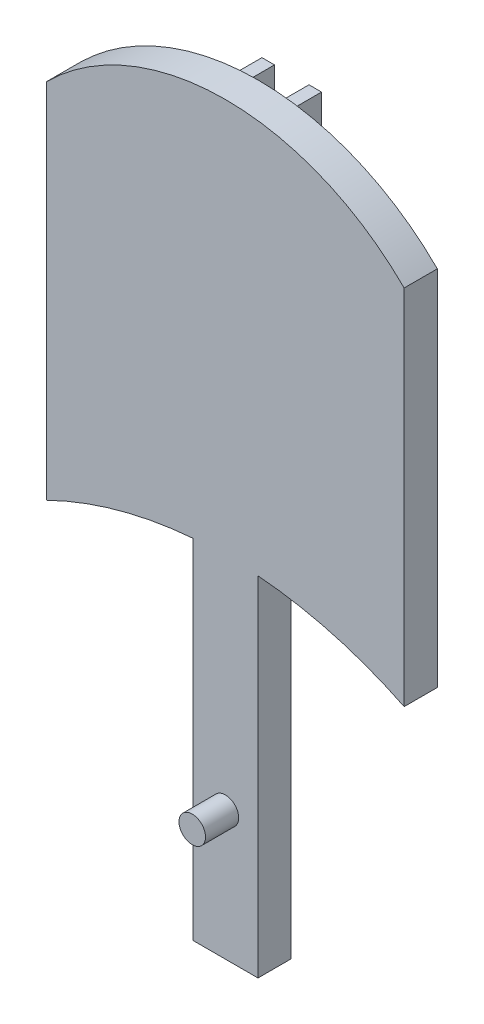
ISO-10303-21;
HEADER;
FILE_DESCRIPTION(('STEP AP214'),'2;1');
FILE_NAME('part.step','',(''),(''),'','','');
FILE_SCHEMA(('AUTOMOTIVE_DESIGN { 1 0 10303 214 1 1 1 1 }'));
ENDSEC;
DATA;
#1=APPLICATION_CONTEXT('core data for automotive mechanical design processes');
#2=APPLICATION_PROTOCOL_DEFINITION('international standard','automotive_design',2000,#1);
#3=PRODUCT_CONTEXT('',#1,'mechanical');
#4=PRODUCT('Part','Part','',(#3));
#5=PRODUCT_RELATED_PRODUCT_CATEGORY('part','',(#4));
#6=PRODUCT_DEFINITION_FORMATION('','',#4);
#7=PRODUCT_DEFINITION_CONTEXT('part definition',#1,'design');
#8=PRODUCT_DEFINITION('design','',#6,#7);
#9=PRODUCT_DEFINITION_SHAPE('','',#8);
#10=(LENGTH_UNIT() NAMED_UNIT(*) SI_UNIT(.MILLI.,.METRE.));
#11=(NAMED_UNIT(*) PLANE_ANGLE_UNIT() SI_UNIT($,.RADIAN.));
#12=(NAMED_UNIT(*) SI_UNIT($,.STERADIAN.) SOLID_ANGLE_UNIT());
#13=UNCERTAINTY_MEASURE_WITH_UNIT(LENGTH_MEASURE(1.E-05),#10,'distance_accuracy_value','');
#14=(GEOMETRIC_REPRESENTATION_CONTEXT(3) GLOBAL_UNCERTAINTY_ASSIGNED_CONTEXT((#13)) GLOBAL_UNIT_ASSIGNED_CONTEXT((#10,
#11,#12)) REPRESENTATION_CONTEXT('',''));
#15=CARTESIAN_POINT('',(0.,0.,0.));
#16=DIRECTION('',(0.,0.,1.));
#17=DIRECTION('',(1.,0.,0.));
#18=AXIS2_PLACEMENT_3D('',#15,#16,#17);
#19=CARTESIAN_POINT('',(0.,-52.2146947063219,3.175));
#20=DIRECTION('',(0.,0.,-1.));
#21=DIRECTION('',(-1.,0.,0.));
#22=AXIS2_PLACEMENT_3D('',#19,#20,#21);
#23=CYLINDRICAL_SURFACE('',#22,38.8318920153463);
#24=CARTESIAN_POINT('',(0.,-52.2146947063219,3.175));
#25=DIRECTION('',(0.,0.,1.));
#26=DIRECTION('',(1.,0.,0.));
#27=AXIS2_PLACEMENT_3D('',#24,#25,#26);
#28=CIRCLE('',#27,38.8318920153463);
#29=CARTESIAN_POINT('',(3.11847985069034,-13.5082234009658,3.175));
#30=VERTEX_POINT('',#29);
#31=CARTESIAN_POINT('',(17.1142533328683,-17.3575839489754,3.175));
#32=VERTEX_POINT('',#31);
#33=EDGE_CURVE('E301',#30,#32,#28,.F.);
#34=ORIENTED_EDGE('',*,*,#33,.F.);
#35=DIRECTION('',(0.,0.,-1.));
#36=VECTOR('',#35,1.);
#37=CARTESIAN_POINT('',(3.11847985069034,-13.5082234009658,3.175));
#38=LINE('',#37,#36);
#39=CARTESIAN_POINT('',(3.11847985069034,-13.5082234009658,0.));
#40=VERTEX_POINT('',#39);
#41=EDGE_CURVE('E209',#30,#40,#38,.T.);
#42=ORIENTED_EDGE('',*,*,#41,.T.);
#43=CARTESIAN_POINT('',(0.,-52.2146947063219,0.));
#44=DIRECTION('',(0.,0.,1.));
#45=DIRECTION('',(1.,0.,0.));
#46=AXIS2_PLACEMENT_3D('',#43,#44,#45);
#47=CIRCLE('',#46,38.8318920153463);
#48=CARTESIAN_POINT('',(17.1142533328683,-17.3575839489754,0.));
#49=VERTEX_POINT('',#48);
#50=EDGE_CURVE('E317',#40,#49,#47,.F.);
#51=ORIENTED_EDGE('',*,*,#50,.T.);
#52=DIRECTION('',(0.,0.,-1.));
#53=VECTOR('',#52,1.);
#54=CARTESIAN_POINT('',(17.1142533328683,-17.3575839489754,3.175));
#55=LINE('',#54,#53);
#56=EDGE_CURVE('E326',#32,#49,#55,.T.);
#57=ORIENTED_EDGE('',*,*,#56,.F.);
#58=EDGE_LOOP('',(#34,#42,#51,#57));
#59=FACE_BOUND('',#58,.T.);
#60=ADVANCED_FACE('F47',(#59),#23,.F.);
#61=CARTESIAN_POINT('',(0.,-52.2146947063219,0.));
#62=DIRECTION('',(0.,0.,1.));
#63=DIRECTION('',(1.,0.,0.));
#64=AXIS2_PLACEMENT_3D('',#61,#62,#63);
#65=CIRCLE('',#64,38.8318920153463);
#66=CARTESIAN_POINT('',(-2.85342673515783,-13.4877816695383,0.));
#67=VERTEX_POINT('',#66);
#68=CARTESIAN_POINT('',(-1.65128861988301,-13.4179283025949,0.));
#69=VERTEX_POINT('',#68);
#70=EDGE_CURVE('E204',#67,#69,#65,.F.);
#71=ORIENTED_EDGE('',*,*,#70,.F.);
#72=DIRECTION('',(0.,0.,1.));
#73=VECTOR('',#72,1.);
#74=CARTESIAN_POINT('',(-2.85342673515783,-13.4877816695383,-3.175));
#75=LINE('',#74,#73);
#76=CARTESIAN_POINT('',(-2.85342673515783,-13.4877816695383,-3.175));
#77=VERTEX_POINT('',#76);
#78=EDGE_CURVE('E233',#77,#67,#75,.T.);
#79=ORIENTED_EDGE('',*,*,#78,.F.);
#80=CARTESIAN_POINT('',(0.,-52.2146947063219,-3.175));
#81=DIRECTION('',(0.,0.,-1.));
#82=DIRECTION('',(-1.,0.,0.));
#83=AXIS2_PLACEMENT_3D('',#80,#81,#82);
#84=CIRCLE('',#83,38.8318920153463);
#85=CARTESIAN_POINT('',(-1.65128861988301,-13.4179283025949,-3.175));
#86=VERTEX_POINT('',#85);
#87=EDGE_CURVE('E253',#86,#77,#84,.F.);
#88=ORIENTED_EDGE('',*,*,#87,.F.);
#89=DIRECTION('',(0.,0.,1.));
#90=VECTOR('',#89,1.);
#91=CARTESIAN_POINT('',(-1.65128861988301,-13.4179283025949,-3.175));
#92=LINE('',#91,#90);
#93=EDGE_CURVE('E269',#86,#69,#92,.T.);
#94=ORIENTED_EDGE('',*,*,#93,.T.);
#95=EDGE_LOOP('',(#71,#79,#88,#94));
#96=FACE_BOUND('',#95,.T.);
#97=ADVANCED_FACE('F379',(#96),#23,.F.);
#98=CARTESIAN_POINT('',(1.65128861988301,-13.4179283025949,0.));
#99=VERTEX_POINT('',#98);
#100=CARTESIAN_POINT('',(2.85342673515783,-13.4877816695383,0.));
#101=VERTEX_POINT('',#100);
#102=EDGE_CURVE('E202',#99,#101,#65,.F.);
#103=ORIENTED_EDGE('',*,*,#102,.F.);
#104=DIRECTION('',(0.,0.,1.));
#105=VECTOR('',#104,1.);
#106=CARTESIAN_POINT('',(1.65128861988301,-13.4179283025949,-3.175));
#107=LINE('',#106,#105);
#108=CARTESIAN_POINT('',(1.65128861988301,-13.4179283025949,-3.175));
#109=VERTEX_POINT('',#108);
#110=EDGE_CURVE('E229',#109,#99,#107,.T.);
#111=ORIENTED_EDGE('',*,*,#110,.F.);
#112=CARTESIAN_POINT('',(0.,-52.2146947063219,-3.175));
#113=DIRECTION('',(0.,0.,-1.));
#114=DIRECTION('',(-1.,0.,0.));
#115=AXIS2_PLACEMENT_3D('',#112,#113,#114);
#116=CIRCLE('',#115,38.8318920153463);
#117=CARTESIAN_POINT('',(2.85342673515783,-13.4877816695383,-3.175));
#118=VERTEX_POINT('',#117);
#119=EDGE_CURVE('E226',#118,#109,#116,.F.);
#120=ORIENTED_EDGE('',*,*,#119,.F.);
#121=DIRECTION('',(0.,0.,1.));
#122=VECTOR('',#121,1.);
#123=CARTESIAN_POINT('',(2.85342673515783,-13.4877816695383,-3.175));
#124=LINE('',#123,#122);
#125=EDGE_CURVE('E241',#118,#101,#124,.T.);
#126=ORIENTED_EDGE('',*,*,#125,.T.);
#127=EDGE_LOOP('',(#103,#111,#120,#126));
#128=FACE_BOUND('',#127,.T.);
#129=ADVANCED_FACE('F355',(#128),#23,.F.);
#130=CARTESIAN_POINT('',(0.,0.,0.));
#131=DIRECTION('',(0.,0.,1.));
#132=DIRECTION('',(1.,0.,0.));
#133=AXIS2_PLACEMENT_3D('',#130,#131,#132);
#134=PLANE('',#133);
#135=DIRECTION('',(0.,-1.,0.));
#136=VECTOR('',#135,1.);
#137=CARTESIAN_POINT('',(-3.11847985069032,0.338888516574702,0.));
#138=LINE('',#137,#136);
#139=CARTESIAN_POINT('',(-3.11847985069032,-13.5082234009658,0.));
#140=VERTEX_POINT('',#139);
#141=CARTESIAN_POINT('',(-3.11847985069032,-46.8558230045354,0.));
#142=VERTEX_POINT('',#141);
#143=EDGE_CURVE('E163',#140,#142,#138,.T.);
#144=ORIENTED_EDGE('',*,*,#143,.F.);
#145=CARTESIAN_POINT('',(-17.1142533328683,-17.3575839489754,0.));
#146=VERTEX_POINT('',#145);
#147=EDGE_CURVE('E318',#146,#140,#47,.F.);
#148=ORIENTED_EDGE('',*,*,#147,.F.);
#149=DIRECTION('',(0.,1.,0.));
#150=VECTOR('',#149,1.);
#151=CARTESIAN_POINT('',(-17.1142533328683,0.,0.));
#152=LINE('',#151,#150);
#153=CARTESIAN_POINT('',(-17.1142533328683,17.3575839489754,0.));
#154=VERTEX_POINT('',#153);
#155=EDGE_CURVE('E313',#146,#154,#152,.T.);
#156=ORIENTED_EDGE('',*,*,#155,.T.);
#157=CARTESIAN_POINT('',(0.,0.194287236116569,0.));
#158=DIRECTION('',(0.,0.,1.));
#159=DIRECTION('',(1.,0.,0.));
#160=AXIS2_PLACEMENT_3D('',#157,#158,#159);
#161=CIRCLE('',#160,24.2379128885971);
#162=CARTESIAN_POINT('',(17.1142533328683,17.3575839489754,0.));
#163=VERTEX_POINT('',#162);
#164=EDGE_CURVE('E252',#154,#163,#161,.F.);
#165=ORIENTED_EDGE('',*,*,#164,.T.);
#166=DIRECTION('',(0.,1.,0.));
#167=VECTOR('',#166,1.);
#168=CARTESIAN_POINT('',(17.1142533328683,0.,0.));
#169=LINE('',#168,#167);
#170=EDGE_CURVE('E297',#49,#163,#169,.T.);
#171=ORIENTED_EDGE('',*,*,#170,.F.);
#172=ORIENTED_EDGE('',*,*,#50,.F.);
#173=DIRECTION('',(0.,1.,0.));
#174=VECTOR('',#173,1.);
#175=CARTESIAN_POINT('',(3.11847985069032,0.338888516574709,0.));
#176=LINE('',#175,#174);
#177=CARTESIAN_POINT('',(3.1184798506904,-46.8558230045354,0.));
#178=VERTEX_POINT('',#177);
#179=EDGE_CURVE('E176',#178,#40,#176,.T.);
#180=ORIENTED_EDGE('',*,*,#179,.F.);
#181=DIRECTION('',(1.,0.,0.));
#182=VECTOR('',#181,1.);
#183=CARTESIAN_POINT('',(-3.11847985069032,-46.8558230045354,0.));
#184=LINE('',#183,#182);
#185=EDGE_CURVE('E175',#142,#178,#184,.T.);
#186=ORIENTED_EDGE('',*,*,#185,.F.);
#187=EDGE_LOOP('',(#144,#148,#156,#165,#171,#172,#180,#186));
#188=FACE_BOUND('',#187,.T.);
#189=DIRECTION('',(0.,1.,0.));
#190=VECTOR('',#189,1.);
#191=CARTESIAN_POINT('',(2.85342673515783,0.,0.));
#192=LINE('',#191,#190);
#193=CARTESIAN_POINT('',(2.85342673515783,23.2983529403055,0.));
#194=VERTEX_POINT('',#193);
#195=EDGE_CURVE('E218',#101,#194,#192,.T.);
#196=ORIENTED_EDGE('',*,*,#195,.T.);
#197=DIRECTION('',(-1.,0.,0.));
#198=VECTOR('',#197,1.);
#199=CARTESIAN_POINT('',(0.,23.2983529403055,0.));
#200=LINE('',#199,#198);
#201=CARTESIAN_POINT('',(1.65128861988301,23.2983529403055,0.));
#202=VERTEX_POINT('',#201);
#203=EDGE_CURVE('E232',#194,#202,#200,.T.);
#204=ORIENTED_EDGE('',*,*,#203,.T.);
#205=DIRECTION('',(0.,1.,0.));
#206=VECTOR('',#205,1.);
#207=CARTESIAN_POINT('',(1.65128861988301,0.,0.));
#208=LINE('',#207,#206);
#209=EDGE_CURVE('E71',#99,#202,#208,.T.);
#210=ORIENTED_EDGE('',*,*,#209,.F.);
#211=ORIENTED_EDGE('',*,*,#102,.T.);
#212=EDGE_LOOP('',(#196,#204,#210,#211));
#213=FACE_BOUND('',#212,.T.);
#214=DIRECTION('',(0.,1.,0.));
#215=VECTOR('',#214,1.);
#216=CARTESIAN_POINT('',(-1.65128861988301,0.,0.));
#217=LINE('',#216,#215);
#218=CARTESIAN_POINT('',(-1.65128861988301,23.2983529403055,0.));
#219=VERTEX_POINT('',#218);
#220=EDGE_CURVE('E258',#69,#219,#217,.T.);
#221=ORIENTED_EDGE('',*,*,#220,.T.);
#222=DIRECTION('',(-1.,0.,0.));
#223=VECTOR('',#222,1.);
#224=CARTESIAN_POINT('',(0.,23.2983529403055,0.));
#225=LINE('',#224,#223);
#226=CARTESIAN_POINT('',(-2.85342673515783,23.2983529403055,0.));
#227=VERTEX_POINT('',#226);
#228=EDGE_CURVE('E272',#219,#227,#225,.T.);
#229=ORIENTED_EDGE('',*,*,#228,.T.);
#230=DIRECTION('',(0.,1.,0.));
#231=VECTOR('',#230,1.);
#232=CARTESIAN_POINT('',(-2.85342673515783,0.,0.));
#233=LINE('',#232,#231);
#234=EDGE_CURVE('E213',#67,#227,#233,.T.);
#235=ORIENTED_EDGE('',*,*,#234,.F.);
#236=ORIENTED_EDGE('',*,*,#70,.T.);
#237=EDGE_LOOP('',(#221,#229,#235,#236));
#238=FACE_BOUND('',#237,.T.);
#239=ADVANCED_FACE('F186',(#188,#213,#238),#134,.F.);
#240=CARTESIAN_POINT('',(0.,0.194287236116569,3.175));
#241=DIRECTION('',(0.,0.,-1.));
#242=DIRECTION('',(-1.,0.,0.));
#243=AXIS2_PLACEMENT_3D('',#240,#241,#242);
#244=CYLINDRICAL_SURFACE('',#243,24.2379128885971);
#245=ORIENTED_EDGE('',*,*,#164,.F.);
#246=DIRECTION('',(0.,0.,-1.));
#247=VECTOR('',#246,1.);
#248=CARTESIAN_POINT('',(-17.1142533328683,17.3575839489754,3.175));
#249=LINE('',#248,#247);
#250=CARTESIAN_POINT('',(-17.1142533328683,17.3575839489754,3.175));
#251=VERTEX_POINT('',#250);
#252=EDGE_CURVE('E11',#251,#154,#249,.T.);
#253=ORIENTED_EDGE('',*,*,#252,.F.);
#254=CARTESIAN_POINT('',(0.,0.194287236116569,3.175));
#255=DIRECTION('',(0.,0.,1.));
#256=DIRECTION('',(1.,0.,0.));
#257=AXIS2_PLACEMENT_3D('',#254,#255,#256);
#258=CIRCLE('',#257,24.2379128885971);
#259=CARTESIAN_POINT('',(17.1142533328683,17.3575839489754,3.175));
#260=VERTEX_POINT('',#259);
#261=EDGE_CURVE('E292',#251,#260,#258,.F.);
#262=ORIENTED_EDGE('',*,*,#261,.T.);
#263=DIRECTION('',(0.,0.,-1.));
#264=VECTOR('',#263,1.);
#265=CARTESIAN_POINT('',(17.1142533328683,17.3575839489754,3.175));
#266=LINE('',#265,#264);
#267=EDGE_CURVE('E309',#260,#163,#266,.T.);
#268=ORIENTED_EDGE('',*,*,#267,.T.);
#269=EDGE_LOOP('',(#245,#253,#262,#268));
#270=FACE_BOUND('',#269,.T.);
#271=ADVANCED_FACE('F49',(#270),#244,.T.);
#272=CARTESIAN_POINT('',(-17.1142533328683,0.,3.175));
#273=DIRECTION('',(-1.,0.,0.));
#274=DIRECTION('',(0.,0.,1.));
#275=AXIS2_PLACEMENT_3D('',#272,#273,#274);
#276=PLANE('',#275);
#277=ORIENTED_EDGE('',*,*,#155,.F.);
#278=DIRECTION('',(0.,0.,-1.));
#279=VECTOR('',#278,1.);
#280=CARTESIAN_POINT('',(-17.1142533328683,-17.3575839489754,3.175));
#281=LINE('',#280,#279);
#282=CARTESIAN_POINT('',(-17.1142533328683,-17.3575839489754,3.175));
#283=VERTEX_POINT('',#282);
#284=EDGE_CURVE('E56',#283,#146,#281,.T.);
#285=ORIENTED_EDGE('',*,*,#284,.F.);
#286=DIRECTION('',(0.,1.,0.));
#287=VECTOR('',#286,1.);
#288=CARTESIAN_POINT('',(-17.1142533328683,0.,3.175));
#289=LINE('',#288,#287);
#290=EDGE_CURVE('E296',#283,#251,#289,.T.);
#291=ORIENTED_EDGE('',*,*,#290,.T.);
#292=ORIENTED_EDGE('',*,*,#252,.T.);
#293=EDGE_LOOP('',(#277,#285,#291,#292));
#294=FACE_BOUND('',#293,.T.);
#295=ADVANCED_FACE('F336',(#294),#276,.T.);
#296=ORIENTED_EDGE('',*,*,#147,.T.);
#297=DIRECTION('',(0.,0.,-1.));
#298=VECTOR('',#297,1.);
#299=CARTESIAN_POINT('',(-3.11847985069032,-13.5082234009658,3.175));
#300=LINE('',#299,#298);
#301=CARTESIAN_POINT('',(-3.11847985069032,-13.5082234009658,3.175));
#302=VERTEX_POINT('',#301);
#303=EDGE_CURVE('E169',#140,#302,#300,.F.);
#304=ORIENTED_EDGE('',*,*,#303,.T.);
#305=EDGE_CURVE('E302',#283,#302,#28,.F.);
#306=ORIENTED_EDGE('',*,*,#305,.F.);
#307=ORIENTED_EDGE('',*,*,#284,.T.);
#308=EDGE_LOOP('',(#296,#304,#306,#307));
#309=FACE_BOUND('',#308,.T.);
#310=ADVANCED_FACE('F332',(#309),#23,.F.);
#311=CARTESIAN_POINT('',(17.1142533328683,0.,3.175));
#312=DIRECTION('',(-1.,0.,0.));
#313=DIRECTION('',(0.,0.,1.));
#314=AXIS2_PLACEMENT_3D('',#311,#312,#313);
#315=PLANE('',#314);
#316=ORIENTED_EDGE('',*,*,#170,.T.);
#317=ORIENTED_EDGE('',*,*,#267,.F.);
#318=DIRECTION('',(0.,1.,0.));
#319=VECTOR('',#318,1.);
#320=CARTESIAN_POINT('',(17.1142533328683,0.,3.175));
#321=LINE('',#320,#319);
#322=EDGE_CURVE('E306',#32,#260,#321,.T.);
#323=ORIENTED_EDGE('',*,*,#322,.F.);
#324=ORIENTED_EDGE('',*,*,#56,.T.);
#325=EDGE_LOOP('',(#316,#317,#323,#324));
#326=FACE_BOUND('',#325,.T.);
#327=ADVANCED_FACE('F343',(#326),#315,.F.);
#328=CARTESIAN_POINT('',(0.,0.,3.175));
#329=DIRECTION('',(0.,0.,1.));
#330=DIRECTION('',(1.,0.,0.));
#331=AXIS2_PLACEMENT_3D('',#328,#329,#330);
#332=PLANE('',#331);
#333=CARTESIAN_POINT('',(0.,-34.5036834153857,3.175));
#334=DIRECTION('',(0.,0.,1.));
#335=DIRECTION('',(1.,0.,0.));
#336=AXIS2_PLACEMENT_3D('',#333,#334,#335);
#337=CIRCLE('',#336,1.27);
#338=CARTESIAN_POINT('',(1.27,-34.5036834153857,3.175));
#339=VERTEX_POINT('',#338);
#340=EDGE_CURVE('E585',#339,#339,#337,.T.);
#341=ORIENTED_EDGE('',*,*,#340,.F.);
#342=EDGE_LOOP('',(#341));
#343=FACE_BOUND('',#342,.T.);
#344=ORIENTED_EDGE('',*,*,#305,.T.);
#345=DIRECTION('',(0.,-1.,0.));
#346=VECTOR('',#345,1.);
#347=CARTESIAN_POINT('',(-3.11847985069032,0.338888516574702,3.175));
#348=LINE('',#347,#346);
#349=CARTESIAN_POINT('',(-3.11847985069032,-46.8558230045354,3.175));
#350=VERTEX_POINT('',#349);
#351=EDGE_CURVE('E195',#302,#350,#348,.T.);
#352=ORIENTED_EDGE('',*,*,#351,.T.);
#353=DIRECTION('',(1.,0.,0.));
#354=VECTOR('',#353,1.);
#355=CARTESIAN_POINT('',(-3.11847985069032,-46.8558230045354,3.175));
#356=LINE('',#355,#354);
#357=CARTESIAN_POINT('',(3.1184798506904,-46.8558230045354,3.175));
#358=VERTEX_POINT('',#357);
#359=EDGE_CURVE('E181',#350,#358,#356,.T.);
#360=ORIENTED_EDGE('',*,*,#359,.T.);
#361=DIRECTION('',(0.,1.,0.));
#362=VECTOR('',#361,1.);
#363=CARTESIAN_POINT('',(3.11847985069032,0.338888516574709,3.175));
#364=LINE('',#363,#362);
#365=EDGE_CURVE('E63',#358,#30,#364,.T.);
#366=ORIENTED_EDGE('',*,*,#365,.T.);
#367=ORIENTED_EDGE('',*,*,#33,.T.);
#368=ORIENTED_EDGE('',*,*,#322,.T.);
#369=ORIENTED_EDGE('',*,*,#261,.F.);
#370=ORIENTED_EDGE('',*,*,#290,.F.);
#371=EDGE_LOOP('',(#344,#352,#360,#366,#367,#368,#369,#370));
#372=FACE_BOUND('',#371,.T.);
#373=ADVANCED_FACE('F392',(#343,#372),#332,.T.);
#374=CARTESIAN_POINT('',(-2.85342673515783,0.,-3.175));
#375=DIRECTION('',(1.,0.,0.));
#376=DIRECTION('',(0.,0.,-1.));
#377=AXIS2_PLACEMENT_3D('',#374,#375,#376);
#378=PLANE('',#377);
#379=ORIENTED_EDGE('',*,*,#234,.T.);
#380=DIRECTION('',(0.,0.,1.));
#381=VECTOR('',#380,1.);
#382=CARTESIAN_POINT('',(-2.85342673515783,23.2983529403055,-3.175));
#383=LINE('',#382,#381);
#384=CARTESIAN_POINT('',(-2.85342673515783,23.2983529403055,-3.175));
#385=VERTEX_POINT('',#384);
#386=EDGE_CURVE('E285',#385,#227,#383,.T.);
#387=ORIENTED_EDGE('',*,*,#386,.F.);
#388=DIRECTION('',(0.,1.,0.));
#389=VECTOR('',#388,1.);
#390=CARTESIAN_POINT('',(-2.85342673515783,0.,-3.175));
#391=LINE('',#390,#389);
#392=EDGE_CURVE('E257',#77,#385,#391,.T.);
#393=ORIENTED_EDGE('',*,*,#392,.F.);
#394=ORIENTED_EDGE('',*,*,#78,.T.);
#395=EDGE_LOOP('',(#379,#387,#393,#394));
#396=FACE_BOUND('',#395,.T.);
#397=ADVANCED_FACE('F404',(#396),#378,.F.);
#398=CARTESIAN_POINT('',(0.,23.2983529403055,-3.175));
#399=DIRECTION('',(0.,1.,0.));
#400=DIRECTION('',(0.,0.,1.));
#401=AXIS2_PLACEMENT_3D('',#398,#399,#400);
#402=PLANE('',#401);
#403=ORIENTED_EDGE('',*,*,#228,.F.);
#404=DIRECTION('',(0.,0.,1.));
#405=VECTOR('',#404,1.);
#406=CARTESIAN_POINT('',(-1.65128861988301,23.2983529403055,-3.175));
#407=LINE('',#406,#405);
#408=CARTESIAN_POINT('',(-1.65128861988301,23.2983529403055,-3.175));
#409=VERTEX_POINT('',#408);
#410=EDGE_CURVE('E281',#409,#219,#407,.T.);
#411=ORIENTED_EDGE('',*,*,#410,.F.);
#412=DIRECTION('',(-1.,0.,0.));
#413=VECTOR('',#412,1.);
#414=CARTESIAN_POINT('',(0.,23.2983529403055,-3.175));
#415=LINE('',#414,#413);
#416=EDGE_CURVE('E261',#409,#385,#415,.T.);
#417=ORIENTED_EDGE('',*,*,#416,.T.);
#418=ORIENTED_EDGE('',*,*,#386,.T.);
#419=EDGE_LOOP('',(#403,#411,#417,#418));
#420=FACE_BOUND('',#419,.T.);
#421=ADVANCED_FACE('F407',(#420),#402,.T.);
#422=CARTESIAN_POINT('',(-1.65128861988301,0.,-3.175));
#423=DIRECTION('',(1.,0.,0.));
#424=DIRECTION('',(0.,0.,-1.));
#425=AXIS2_PLACEMENT_3D('',#422,#423,#424);
#426=PLANE('',#425);
#427=ORIENTED_EDGE('',*,*,#220,.F.);
#428=ORIENTED_EDGE('',*,*,#93,.F.);
#429=DIRECTION('',(0.,1.,0.));
#430=VECTOR('',#429,1.);
#431=CARTESIAN_POINT('',(-1.65128861988301,0.,-3.175));
#432=LINE('',#431,#430);
#433=EDGE_CURVE('E265',#86,#409,#432,.T.);
#434=ORIENTED_EDGE('',*,*,#433,.T.);
#435=ORIENTED_EDGE('',*,*,#410,.T.);
#436=EDGE_LOOP('',(#427,#428,#434,#435));
#437=FACE_BOUND('',#436,.T.);
#438=ADVANCED_FACE('F411',(#437),#426,.T.);
#439=CARTESIAN_POINT('',(0.,0.,-3.175));
#440=DIRECTION('',(0.,0.,-1.));
#441=DIRECTION('',(-1.,0.,0.));
#442=AXIS2_PLACEMENT_3D('',#439,#440,#441);
#443=PLANE('',#442);
#444=ORIENTED_EDGE('',*,*,#87,.T.);
#445=ORIENTED_EDGE('',*,*,#392,.T.);
#446=ORIENTED_EDGE('',*,*,#416,.F.);
#447=ORIENTED_EDGE('',*,*,#433,.F.);
#448=EDGE_LOOP('',(#444,#445,#446,#447));
#449=FACE_BOUND('',#448,.T.);
#450=ADVANCED_FACE('F415',(#449),#443,.T.);
#451=CARTESIAN_POINT('',(1.65128861988301,0.,-3.175));
#452=DIRECTION('',(1.,0.,0.));
#453=DIRECTION('',(0.,0.,-1.));
#454=AXIS2_PLACEMENT_3D('',#451,#452,#453);
#455=PLANE('',#454);
#456=ORIENTED_EDGE('',*,*,#209,.T.);
#457=DIRECTION('',(0.,0.,1.));
#458=VECTOR('',#457,1.);
#459=CARTESIAN_POINT('',(1.65128861988301,23.2983529403055,-3.175));
#460=LINE('',#459,#458);
#461=CARTESIAN_POINT('',(1.65128861988301,23.2983529403055,-3.175));
#462=VERTEX_POINT('',#461);
#463=EDGE_CURVE('E249',#462,#202,#460,.T.);
#464=ORIENTED_EDGE('',*,*,#463,.F.);
#465=DIRECTION('',(0.,1.,0.));
#466=VECTOR('',#465,1.);
#467=CARTESIAN_POINT('',(1.65128861988301,0.,-3.175));
#468=LINE('',#467,#466);
#469=EDGE_CURVE('E214',#109,#462,#468,.T.);
#470=ORIENTED_EDGE('',*,*,#469,.F.);
#471=ORIENTED_EDGE('',*,*,#110,.T.);
#472=EDGE_LOOP('',(#456,#464,#470,#471));
#473=FACE_BOUND('',#472,.T.);
#474=ADVANCED_FACE('F364',(#473),#455,.F.);
#475=CARTESIAN_POINT('',(0.,23.2983529403055,-3.175));
#476=DIRECTION('',(0.,1.,0.));
#477=DIRECTION('',(0.,0.,1.));
#478=AXIS2_PLACEMENT_3D('',#475,#476,#477);
#479=PLANE('',#478);
#480=ORIENTED_EDGE('',*,*,#203,.F.);
#481=DIRECTION('',(0.,0.,1.));
#482=VECTOR('',#481,1.);
#483=CARTESIAN_POINT('',(2.85342673515783,23.2983529403055,-3.175));
#484=LINE('',#483,#482);
#485=CARTESIAN_POINT('',(2.85342673515783,23.2983529403055,-3.175));
#486=VERTEX_POINT('',#485);
#487=EDGE_CURVE('E245',#486,#194,#484,.T.);
#488=ORIENTED_EDGE('',*,*,#487,.F.);
#489=DIRECTION('',(-1.,0.,0.));
#490=VECTOR('',#489,1.);
#491=CARTESIAN_POINT('',(0.,23.2983529403055,-3.175));
#492=LINE('',#491,#490);
#493=EDGE_CURVE('E217',#486,#462,#492,.T.);
#494=ORIENTED_EDGE('',*,*,#493,.T.);
#495=ORIENTED_EDGE('',*,*,#463,.T.);
#496=EDGE_LOOP('',(#480,#488,#494,#495));
#497=FACE_BOUND('',#496,.T.);
#498=ADVANCED_FACE('F362',(#497),#479,.T.);
#499=CARTESIAN_POINT('',(2.85342673515783,0.,-3.175));
#500=DIRECTION('',(1.,0.,0.));
#501=DIRECTION('',(0.,0.,-1.));
#502=AXIS2_PLACEMENT_3D('',#499,#500,#501);
#503=PLANE('',#502);
#504=ORIENTED_EDGE('',*,*,#195,.F.);
#505=ORIENTED_EDGE('',*,*,#125,.F.);
#506=DIRECTION('',(0.,1.,0.));
#507=VECTOR('',#506,1.);
#508=CARTESIAN_POINT('',(2.85342673515783,0.,-3.175));
#509=LINE('',#508,#507);
#510=EDGE_CURVE('E222',#118,#486,#509,.T.);
#511=ORIENTED_EDGE('',*,*,#510,.T.);
#512=ORIENTED_EDGE('',*,*,#487,.T.);
#513=EDGE_LOOP('',(#504,#505,#511,#512));
#514=FACE_BOUND('',#513,.T.);
#515=ADVANCED_FACE('F358',(#514),#503,.T.);
#516=CARTESIAN_POINT('',(0.,0.,-3.175));
#517=DIRECTION('',(0.,0.,-1.));
#518=DIRECTION('',(-1.,0.,0.));
#519=AXIS2_PLACEMENT_3D('',#516,#517,#518);
#520=PLANE('',#519);
#521=ORIENTED_EDGE('',*,*,#469,.T.);
#522=ORIENTED_EDGE('',*,*,#493,.F.);
#523=ORIENTED_EDGE('',*,*,#510,.F.);
#524=ORIENTED_EDGE('',*,*,#119,.T.);
#525=EDGE_LOOP('',(#521,#522,#523,#524));
#526=FACE_BOUND('',#525,.T.);
#527=ADVANCED_FACE('F366',(#526),#520,.T.);
#528=CARTESIAN_POINT('',(3.11847985069032,0.338888516574709,0.));
#529=DIRECTION('',(1.,0.,0.));
#530=DIRECTION('',(0.,1.,0.));
#531=AXIS2_PLACEMENT_3D('',#528,#529,#530);
#532=PLANE('',#531);
#533=ORIENTED_EDGE('',*,*,#41,.F.);
#534=ORIENTED_EDGE('',*,*,#365,.F.);
#535=DIRECTION('',(0.,0.,1.));
#536=VECTOR('',#535,1.);
#537=CARTESIAN_POINT('',(3.1184798506904,-46.8558230045354,0.));
#538=LINE('',#537,#536);
#539=EDGE_CURVE('E183',#178,#358,#538,.T.);
#540=ORIENTED_EDGE('',*,*,#539,.F.);
#541=ORIENTED_EDGE('',*,*,#179,.T.);
#542=EDGE_LOOP('',(#533,#534,#540,#541));
#543=FACE_BOUND('',#542,.T.);
#544=ADVANCED_FACE('F368',(#543),#532,.T.);
#545=CARTESIAN_POINT('',(-3.11847985069032,0.338888516574702,0.));
#546=DIRECTION('',(-1.,0.,0.));
#547=DIRECTION('',(0.,0.,1.));
#548=AXIS2_PLACEMENT_3D('',#545,#546,#547);
#549=PLANE('',#548);
#550=ORIENTED_EDGE('',*,*,#303,.F.);
#551=ORIENTED_EDGE('',*,*,#143,.T.);
#552=DIRECTION('',(0.,0.,1.));
#553=VECTOR('',#552,1.);
#554=CARTESIAN_POINT('',(-3.11847985069032,-46.8558230045354,0.));
#555=LINE('',#554,#553);
#556=EDGE_CURVE('E166',#142,#350,#555,.T.);
#557=ORIENTED_EDGE('',*,*,#556,.T.);
#558=ORIENTED_EDGE('',*,*,#351,.F.);
#559=EDGE_LOOP('',(#550,#551,#557,#558));
#560=FACE_BOUND('',#559,.T.);
#561=ADVANCED_FACE('F165',(#560),#549,.T.);
#562=CARTESIAN_POINT('',(-3.11847985069032,-46.8558230045354,0.));
#563=DIRECTION('',(0.,-1.,0.));
#564=DIRECTION('',(0.,0.,-1.));
#565=AXIS2_PLACEMENT_3D('',#562,#563,#564);
#566=PLANE('',#565);
#567=ORIENTED_EDGE('',*,*,#359,.F.);
#568=ORIENTED_EDGE('',*,*,#556,.F.);
#569=ORIENTED_EDGE('',*,*,#185,.T.);
#570=ORIENTED_EDGE('',*,*,#539,.T.);
#571=EDGE_LOOP('',(#567,#568,#569,#570));
#572=FACE_BOUND('',#571,.T.);
#573=ADVANCED_FACE('F180',(#572),#566,.T.);
#574=CARTESIAN_POINT('',(0.,-34.5036834153857,6.35));
#575=DIRECTION('',(0.,0.,-1.));
#576=DIRECTION('',(-1.,0.,0.));
#577=AXIS2_PLACEMENT_3D('',#574,#575,#576);
#578=CYLINDRICAL_SURFACE('',#577,1.27);
#579=CARTESIAN_POINT('',(0.,-34.5036834153857,6.35));
#580=DIRECTION('',(0.,0.,1.));
#581=DIRECTION('',(1.,0.,0.));
#582=AXIS2_PLACEMENT_3D('',#579,#580,#581);
#583=CIRCLE('',#582,1.27);
#584=CARTESIAN_POINT('',(1.27,-34.5036834153857,6.35));
#585=VERTEX_POINT('',#584);
#586=EDGE_CURVE('E196',#585,#585,#583,.T.);
#587=ORIENTED_EDGE('',*,*,#586,.F.);
#588=EDGE_LOOP('',(#587));
#589=FACE_BOUND('',#588,.T.);
#590=ORIENTED_EDGE('',*,*,#340,.T.);
#591=EDGE_LOOP('',(#590));
#592=FACE_BOUND('',#591,.T.);
#593=ADVANCED_FACE('F542',(#589,#592),#578,.T.);
#594=CARTESIAN_POINT('',(0.,0.,6.35));
#595=DIRECTION('',(0.,0.,1.));
#596=DIRECTION('',(1.,0.,0.));
#597=AXIS2_PLACEMENT_3D('',#594,#595,#596);
#598=PLANE('',#597);
#599=ORIENTED_EDGE('',*,*,#586,.T.);
#600=EDGE_LOOP('',(#599));
#601=FACE_BOUND('',#600,.T.);
#602=ADVANCED_FACE('F550',(#601),#598,.T.);
#603=CLOSED_SHELL('',(#60,#97,#129,#239,#271,#295,#310,#327,#373,#397,#421,#438,#450,#474,#498,
#515,#527,#544,#561,#573,#593,#602));
#604=MANIFOLD_SOLID_BREP('B2',#603);
#605=ADVANCED_BREP_SHAPE_REPRESENTATION('',(#18,#604),#14);
#606=SHAPE_DEFINITION_REPRESENTATION(#9,#605);
ENDSEC;
END-ISO-10303-21;
